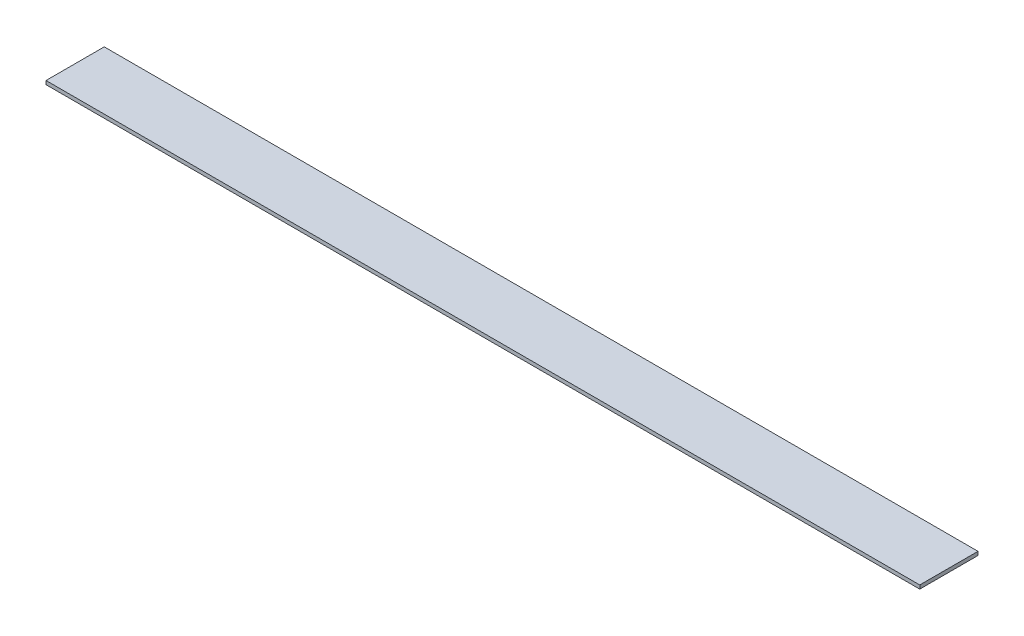
ISO-10303-21;
HEADER;
FILE_DESCRIPTION(('STEP AP214'),'2;1');
FILE_NAME('part.step','',(''),(''),'','','');
FILE_SCHEMA(('AUTOMOTIVE_DESIGN { 1 0 10303 214 1 1 1 1 }'));
ENDSEC;
DATA;
#1=APPLICATION_CONTEXT('core data for automotive mechanical design processes');
#2=APPLICATION_PROTOCOL_DEFINITION('international standard','automotive_design',2000,#1);
#3=PRODUCT_CONTEXT('',#1,'mechanical');
#4=PRODUCT('Part','Part','',(#3));
#5=PRODUCT_RELATED_PRODUCT_CATEGORY('part','',(#4));
#6=PRODUCT_DEFINITION_FORMATION('','',#4);
#7=PRODUCT_DEFINITION_CONTEXT('part definition',#1,'design');
#8=PRODUCT_DEFINITION('design','',#6,#7);
#9=PRODUCT_DEFINITION_SHAPE('','',#8);
#10=(LENGTH_UNIT() NAMED_UNIT(*) SI_UNIT(.MILLI.,.METRE.));
#11=(NAMED_UNIT(*) PLANE_ANGLE_UNIT() SI_UNIT($,.RADIAN.));
#12=(NAMED_UNIT(*) SI_UNIT($,.STERADIAN.) SOLID_ANGLE_UNIT());
#13=UNCERTAINTY_MEASURE_WITH_UNIT(LENGTH_MEASURE(1.E-05),#10,'distance_accuracy_value','');
#14=(GEOMETRIC_REPRESENTATION_CONTEXT(3) GLOBAL_UNCERTAINTY_ASSIGNED_CONTEXT((#13)) GLOBAL_UNIT_ASSIGNED_CONTEXT((#10,
#11,#12)) REPRESENTATION_CONTEXT('',''));
#15=CARTESIAN_POINT('',(0.,0.,0.));
#16=DIRECTION('',(0.,0.,1.));
#17=DIRECTION('',(1.,0.,0.));
#18=AXIS2_PLACEMENT_3D('',#15,#16,#17);
#19=CARTESIAN_POINT('',(0.,1.5875,0.));
#20=DIRECTION('',(1.,0.,0.));
#21=DIRECTION('',(0.,0.,-1.));
#22=AXIS2_PLACEMENT_3D('',#19,#20,#21);
#23=PLANE('',#22);
#24=DIRECTION('',(0.,0.,1.));
#25=VECTOR('',#24,1.);
#26=CARTESIAN_POINT('',(0.,0.,0.));
#27=LINE('',#26,#25);
#28=CARTESIAN_POINT('',(0.,0.,-25.4));
#29=VERTEX_POINT('',#28);
#30=CARTESIAN_POINT('',(0.,0.,0.));
#31=VERTEX_POINT('',#30);
#32=EDGE_CURVE('E95',#29,#31,#27,.T.);
#33=ORIENTED_EDGE('',*,*,#32,.T.);
#34=DIRECTION('',(0.,-1.,0.));
#35=VECTOR('',#34,1.);
#36=CARTESIAN_POINT('',(0.,1.5875,0.));
#37=LINE('',#36,#35);
#38=CARTESIAN_POINT('',(0.,1.5875,0.));
#39=VERTEX_POINT('',#38);
#40=EDGE_CURVE('E11',#39,#31,#37,.T.);
#41=ORIENTED_EDGE('',*,*,#40,.F.);
#42=DIRECTION('',(0.,0.,1.));
#43=VECTOR('',#42,1.);
#44=CARTESIAN_POINT('',(0.,1.5875,0.));
#45=LINE('',#44,#43);
#46=CARTESIAN_POINT('',(0.,1.5875,-25.4));
#47=VERTEX_POINT('',#46);
#48=EDGE_CURVE('E83',#47,#39,#45,.T.);
#49=ORIENTED_EDGE('',*,*,#48,.F.);
#50=DIRECTION('',(0.,-1.,0.));
#51=VECTOR('',#50,1.);
#52=CARTESIAN_POINT('',(0.,1.5875,-25.4));
#53=LINE('',#52,#51);
#54=EDGE_CURVE('E91',#47,#29,#53,.T.);
#55=ORIENTED_EDGE('',*,*,#54,.T.);
#56=EDGE_LOOP('',(#33,#41,#49,#55));
#57=FACE_BOUND('',#56,.T.);
#58=ADVANCED_FACE('F32',(#57),#23,.F.);
#59=CARTESIAN_POINT('',(0.,1.5875,0.));
#60=DIRECTION('',(0.,0.,-1.));
#61=DIRECTION('',(-1.,0.,0.));
#62=AXIS2_PLACEMENT_3D('',#59,#60,#61);
#63=PLANE('',#62);
#64=DIRECTION('',(1.,0.,0.));
#65=VECTOR('',#64,1.);
#66=CARTESIAN_POINT('',(0.,0.,0.));
#67=LINE('',#66,#65);
#68=CARTESIAN_POINT('',(381.,0.,0.));
#69=VERTEX_POINT('',#68);
#70=EDGE_CURVE('E87',#31,#69,#67,.T.);
#71=ORIENTED_EDGE('',*,*,#70,.T.);
#72=DIRECTION('',(0.,-1.,0.));
#73=VECTOR('',#72,1.);
#74=CARTESIAN_POINT('',(381.,1.5875,0.));
#75=LINE('',#74,#73);
#76=CARTESIAN_POINT('',(381.,1.5875,0.));
#77=VERTEX_POINT('',#76);
#78=EDGE_CURVE('E40',#77,#69,#75,.T.);
#79=ORIENTED_EDGE('',*,*,#78,.F.);
#80=DIRECTION('',(1.,0.,0.));
#81=VECTOR('',#80,1.);
#82=CARTESIAN_POINT('',(0.,1.5875,0.));
#83=LINE('',#82,#81);
#84=EDGE_CURVE('E78',#39,#77,#83,.T.);
#85=ORIENTED_EDGE('',*,*,#84,.F.);
#86=ORIENTED_EDGE('',*,*,#40,.T.);
#87=EDGE_LOOP('',(#71,#79,#85,#86));
#88=FACE_BOUND('',#87,.T.);
#89=ADVANCED_FACE('F86',(#88),#63,.F.);
#90=CARTESIAN_POINT('',(381.,1.5875,0.));
#91=DIRECTION('',(-1.,0.,0.));
#92=DIRECTION('',(0.,0.,1.));
#93=AXIS2_PLACEMENT_3D('',#90,#91,#92);
#94=PLANE('',#93);
#95=DIRECTION('',(0.,0.,-1.));
#96=VECTOR('',#95,1.);
#97=CARTESIAN_POINT('',(381.,0.,0.));
#98=LINE('',#97,#96);
#99=CARTESIAN_POINT('',(381.,0.,-25.4));
#100=VERTEX_POINT('',#99);
#101=EDGE_CURVE('E65',#69,#100,#98,.T.);
#102=ORIENTED_EDGE('',*,*,#101,.T.);
#103=DIRECTION('',(0.,-1.,0.));
#104=VECTOR('',#103,1.);
#105=CARTESIAN_POINT('',(381.,1.5875,-25.4));
#106=LINE('',#105,#104);
#107=CARTESIAN_POINT('',(381.,1.5875,-25.4));
#108=VERTEX_POINT('',#107);
#109=EDGE_CURVE('E88',#108,#100,#106,.T.);
#110=ORIENTED_EDGE('',*,*,#109,.F.);
#111=DIRECTION('',(0.,0.,-1.));
#112=VECTOR('',#111,1.);
#113=CARTESIAN_POINT('',(381.,1.5875,0.));
#114=LINE('',#113,#112);
#115=EDGE_CURVE('E81',#77,#108,#114,.T.);
#116=ORIENTED_EDGE('',*,*,#115,.F.);
#117=ORIENTED_EDGE('',*,*,#78,.T.);
#118=EDGE_LOOP('',(#102,#110,#116,#117));
#119=FACE_BOUND('',#118,.T.);
#120=ADVANCED_FACE('F89',(#119),#94,.F.);
#121=CARTESIAN_POINT('',(0.,1.5875,-25.4));
#122=DIRECTION('',(0.,0.,1.));
#123=DIRECTION('',(1.,0.,0.));
#124=AXIS2_PLACEMENT_3D('',#121,#122,#123);
#125=PLANE('',#124);
#126=DIRECTION('',(-1.,0.,0.));
#127=VECTOR('',#126,1.);
#128=CARTESIAN_POINT('',(0.,0.,-25.4));
#129=LINE('',#128,#127);
#130=EDGE_CURVE('E71',#100,#29,#129,.T.);
#131=ORIENTED_EDGE('',*,*,#130,.T.);
#132=ORIENTED_EDGE('',*,*,#54,.F.);
#133=DIRECTION('',(-1.,0.,0.));
#134=VECTOR('',#133,1.);
#135=CARTESIAN_POINT('',(0.,1.5875,-25.4));
#136=LINE('',#135,#134);
#137=EDGE_CURVE('E48',#108,#47,#136,.T.);
#138=ORIENTED_EDGE('',*,*,#137,.F.);
#139=ORIENTED_EDGE('',*,*,#109,.T.);
#140=EDGE_LOOP('',(#131,#132,#138,#139));
#141=FACE_BOUND('',#140,.T.);
#142=ADVANCED_FACE('F102',(#141),#125,.F.);
#143=CARTESIAN_POINT('',(0.,1.5875,0.));
#144=DIRECTION('',(0.,-1.,0.));
#145=DIRECTION('',(0.,0.,-1.));
#146=AXIS2_PLACEMENT_3D('',#143,#144,#145);
#147=PLANE('',#146);
#148=ORIENTED_EDGE('',*,*,#48,.T.);
#149=ORIENTED_EDGE('',*,*,#84,.T.);
#150=ORIENTED_EDGE('',*,*,#115,.T.);
#151=ORIENTED_EDGE('',*,*,#137,.T.);
#152=EDGE_LOOP('',(#148,#149,#150,#151));
#153=FACE_BOUND('',#152,.T.);
#154=ADVANCED_FACE('F79',(#153),#147,.F.);
#155=CARTESIAN_POINT('',(0.,0.,0.));
#156=DIRECTION('',(0.,-1.,0.));
#157=DIRECTION('',(0.,0.,-1.));
#158=AXIS2_PLACEMENT_3D('',#155,#156,#157);
#159=PLANE('',#158);
#160=ORIENTED_EDGE('',*,*,#32,.F.);
#161=ORIENTED_EDGE('',*,*,#130,.F.);
#162=ORIENTED_EDGE('',*,*,#101,.F.);
#163=ORIENTED_EDGE('',*,*,#70,.F.);
#164=EDGE_LOOP('',(#160,#161,#162,#163));
#165=FACE_BOUND('',#164,.T.);
#166=ADVANCED_FACE('F105',(#165),#159,.T.);
#167=CLOSED_SHELL('',(#58,#89,#120,#142,#154,#166));
#168=MANIFOLD_SOLID_BREP('B2',#167);
#169=ADVANCED_BREP_SHAPE_REPRESENTATION('',(#18,#168),#14);
#170=SHAPE_DEFINITION_REPRESENTATION(#9,#169);
ENDSEC;
END-ISO-10303-21;
